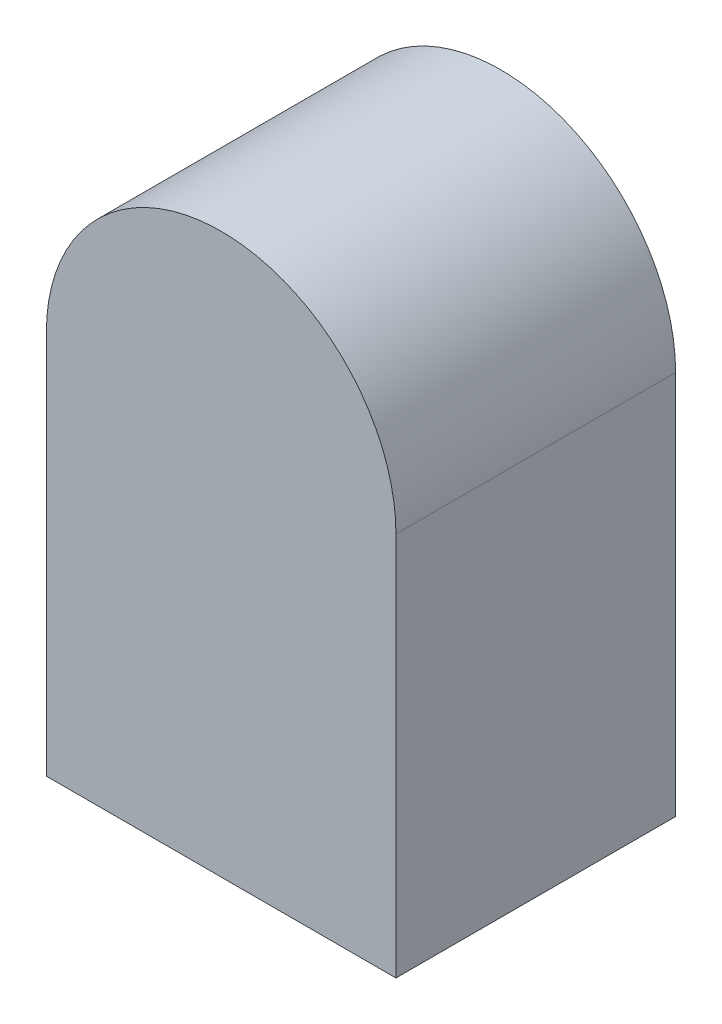
ISO-10303-21;
HEADER;
FILE_DESCRIPTION(('STEP AP214'),'2;1');
FILE_NAME('part.step','',(''),(''),'','','');
FILE_SCHEMA(('AUTOMOTIVE_DESIGN { 1 0 10303 214 1 1 1 1 }'));
ENDSEC;
DATA;
#1=APPLICATION_CONTEXT('core data for automotive mechanical design processes');
#2=APPLICATION_PROTOCOL_DEFINITION('international standard','automotive_design',2000,#1);
#3=PRODUCT_CONTEXT('',#1,'mechanical');
#4=PRODUCT('Part','Part','',(#3));
#5=PRODUCT_RELATED_PRODUCT_CATEGORY('part','',(#4));
#6=PRODUCT_DEFINITION_FORMATION('','',#4);
#7=PRODUCT_DEFINITION_CONTEXT('part definition',#1,'design');
#8=PRODUCT_DEFINITION('design','',#6,#7);
#9=PRODUCT_DEFINITION_SHAPE('','',#8);
#10=(LENGTH_UNIT() NAMED_UNIT(*) SI_UNIT(.MILLI.,.METRE.));
#11=(NAMED_UNIT(*) PLANE_ANGLE_UNIT() SI_UNIT($,.RADIAN.));
#12=(NAMED_UNIT(*) SI_UNIT($,.STERADIAN.) SOLID_ANGLE_UNIT());
#13=UNCERTAINTY_MEASURE_WITH_UNIT(LENGTH_MEASURE(1.E-05),#10,'distance_accuracy_value','');
#14=(GEOMETRIC_REPRESENTATION_CONTEXT(3) GLOBAL_UNCERTAINTY_ASSIGNED_CONTEXT((#13)) GLOBAL_UNIT_ASSIGNED_CONTEXT((#10,
#11,#12)) REPRESENTATION_CONTEXT('',''));
#15=CARTESIAN_POINT('',(0.,0.,0.));
#16=DIRECTION('',(0.,0.,1.));
#17=DIRECTION('',(1.,0.,0.));
#18=AXIS2_PLACEMENT_3D('',#15,#16,#17);
#19=CARTESIAN_POINT('',(0.125000000000004,-0.999999999999999,0.));
#20=DIRECTION('',(1.,0.,0.));
#21=DIRECTION('',(0.,1.,0.));
#22=AXIS2_PLACEMENT_3D('',#19,#20,#21);
#23=PLANE('',#22);
#24=DIRECTION('',(0.,1.,0.));
#25=VECTOR('',#24,1.);
#26=CARTESIAN_POINT('',(0.125000000000004,-0.999999999999999,0.));
#27=LINE('',#26,#25);
#28=CARTESIAN_POINT('',(0.125000000000004,-0.999999999999999,0.));
#29=VERTEX_POINT('',#28);
#30=CARTESIAN_POINT('',(0.125000000000003,-0.724999999999999,0.));
#31=VERTEX_POINT('',#30);
#32=EDGE_CURVE('E11',#29,#31,#27,.T.);
#33=ORIENTED_EDGE('',*,*,#32,.T.);
#34=DIRECTION('',(0.,0.,1.));
#35=VECTOR('',#34,1.);
#36=CARTESIAN_POINT('',(0.125000000000003,-0.724999999999999,0.));
#37=LINE('',#36,#35);
#38=CARTESIAN_POINT('',(0.125000000000003,-0.724999999999999,0.2));
#39=VERTEX_POINT('',#38);
#40=EDGE_CURVE('E24',#31,#39,#37,.T.);
#41=ORIENTED_EDGE('',*,*,#40,.T.);
#42=DIRECTION('',(0.,1.,0.));
#43=VECTOR('',#42,1.);
#44=CARTESIAN_POINT('',(0.125000000000004,-0.999999999999999,0.2));
#45=LINE('',#44,#43);
#46=CARTESIAN_POINT('',(0.125000000000004,-0.999999999999999,0.2));
#47=VERTEX_POINT('',#46);
#48=EDGE_CURVE('E75',#47,#39,#45,.T.);
#49=ORIENTED_EDGE('',*,*,#48,.F.);
#50=DIRECTION('',(0.,0.,1.));
#51=VECTOR('',#50,1.);
#52=CARTESIAN_POINT('',(0.125000000000004,-0.999999999999999,0.));
#53=LINE('',#52,#51);
#54=EDGE_CURVE('E86',#29,#47,#53,.T.);
#55=ORIENTED_EDGE('',*,*,#54,.F.);
#56=EDGE_LOOP('',(#33,#41,#49,#55));
#57=FACE_BOUND('',#56,.T.);
#58=ADVANCED_FACE('F17',(#57),#23,.T.);
#59=CARTESIAN_POINT('',(-0.124999999999991,-1.,0.));
#60=DIRECTION('',(0.,-1.,0.));
#61=DIRECTION('',(1.,0.,0.));
#62=AXIS2_PLACEMENT_3D('',#59,#60,#61);
#63=PLANE('',#62);
#64=DIRECTION('',(1.,0.,0.));
#65=VECTOR('',#64,1.);
#66=CARTESIAN_POINT('',(-0.124999999999991,-1.,0.));
#67=LINE('',#66,#65);
#68=CARTESIAN_POINT('',(-0.124999999999991,-1.,0.));
#69=VERTEX_POINT('',#68);
#70=EDGE_CURVE('E83',#69,#29,#67,.T.);
#71=ORIENTED_EDGE('',*,*,#70,.T.);
#72=ORIENTED_EDGE('',*,*,#54,.T.);
#73=DIRECTION('',(1.,0.,0.));
#74=VECTOR('',#73,1.);
#75=CARTESIAN_POINT('',(-0.124999999999991,-1.,0.2));
#76=LINE('',#75,#74);
#77=CARTESIAN_POINT('',(-0.124999999999991,-1.,0.2));
#78=VERTEX_POINT('',#77);
#79=EDGE_CURVE('E81',#78,#47,#76,.T.);
#80=ORIENTED_EDGE('',*,*,#79,.F.);
#81=DIRECTION('',(0.,0.,1.));
#82=VECTOR('',#81,1.);
#83=CARTESIAN_POINT('',(-0.124999999999991,-1.,0.));
#84=LINE('',#83,#82);
#85=EDGE_CURVE('E61',#69,#78,#84,.T.);
#86=ORIENTED_EDGE('',*,*,#85,.F.);
#87=EDGE_LOOP('',(#71,#72,#80,#86));
#88=FACE_BOUND('',#87,.T.);
#89=ADVANCED_FACE('F91',(#88),#63,.T.);
#90=CARTESIAN_POINT('',(-0.124999999999992,-0.724999999999999,0.));
#91=DIRECTION('',(-1.,0.,0.));
#92=DIRECTION('',(0.,-1.,0.));
#93=AXIS2_PLACEMENT_3D('',#90,#91,#92);
#94=PLANE('',#93);
#95=DIRECTION('',(0.,-1.,0.));
#96=VECTOR('',#95,1.);
#97=CARTESIAN_POINT('',(-0.124999999999992,-0.724999999999999,0.));
#98=LINE('',#97,#96);
#99=CARTESIAN_POINT('',(-0.124999999999992,-0.724999999999999,0.));
#100=VERTEX_POINT('',#99);
#101=EDGE_CURVE('E65',#100,#69,#98,.T.);
#102=ORIENTED_EDGE('',*,*,#101,.T.);
#103=ORIENTED_EDGE('',*,*,#85,.T.);
#104=DIRECTION('',(0.,-1.,0.));
#105=VECTOR('',#104,1.);
#106=CARTESIAN_POINT('',(-0.124999999999992,-0.724999999999999,0.2));
#107=LINE('',#106,#105);
#108=CARTESIAN_POINT('',(-0.124999999999992,-0.724999999999999,0.2));
#109=VERTEX_POINT('',#108);
#110=EDGE_CURVE('E54',#109,#78,#107,.T.);
#111=ORIENTED_EDGE('',*,*,#110,.F.);
#112=DIRECTION('',(0.,0.,1.));
#113=VECTOR('',#112,1.);
#114=CARTESIAN_POINT('',(-0.124999999999992,-0.724999999999999,0.));
#115=LINE('',#114,#113);
#116=EDGE_CURVE('E58',#100,#109,#115,.T.);
#117=ORIENTED_EDGE('',*,*,#116,.F.);
#118=EDGE_LOOP('',(#102,#103,#111,#117));
#119=FACE_BOUND('',#118,.T.);
#120=ADVANCED_FACE('F57',(#119),#94,.T.);
#121=CARTESIAN_POINT('',(0.,-0.724999999999999,0.));
#122=DIRECTION('',(0.,0.,1.));
#123=DIRECTION('',(1.,0.,0.));
#124=AXIS2_PLACEMENT_3D('',#121,#122,#123);
#125=CYLINDRICAL_SURFACE('',#124,0.125);
#126=CARTESIAN_POINT('',(0.,-0.724999999999999,0.));
#127=DIRECTION('',(0.,0.,1.));
#128=DIRECTION('',(1.,0.,0.));
#129=AXIS2_PLACEMENT_3D('',#126,#127,#128);
#130=CIRCLE('',#129,0.125);
#131=EDGE_CURVE('E71',#31,#100,#130,.T.);
#132=ORIENTED_EDGE('',*,*,#131,.T.);
#133=ORIENTED_EDGE('',*,*,#116,.T.);
#134=CARTESIAN_POINT('',(0.,-0.724999999999999,0.2));
#135=DIRECTION('',(0.,0.,1.));
#136=DIRECTION('',(1.,0.,0.));
#137=AXIS2_PLACEMENT_3D('',#134,#135,#136);
#138=CIRCLE('',#137,0.125);
#139=EDGE_CURVE('E70',#39,#109,#138,.T.);
#140=ORIENTED_EDGE('',*,*,#139,.F.);
#141=ORIENTED_EDGE('',*,*,#40,.F.);
#142=EDGE_LOOP('',(#132,#133,#140,#141));
#143=FACE_BOUND('',#142,.T.);
#144=ADVANCED_FACE('F69',(#143),#125,.T.);
#145=CARTESIAN_POINT('',(0.,-0.799999999999999,0.2));
#146=DIRECTION('',(0.,0.,1.));
#147=DIRECTION('',(1.,0.,0.));
#148=AXIS2_PLACEMENT_3D('',#145,#146,#147);
#149=PLANE('',#148);
#150=ORIENTED_EDGE('',*,*,#139,.T.);
#151=ORIENTED_EDGE('',*,*,#110,.T.);
#152=ORIENTED_EDGE('',*,*,#79,.T.);
#153=ORIENTED_EDGE('',*,*,#48,.T.);
#154=EDGE_LOOP('',(#150,#151,#152,#153));
#155=FACE_BOUND('',#154,.T.);
#156=ADVANCED_FACE('F74',(#155),#149,.T.);
#157=CARTESIAN_POINT('',(0.,-0.799999999999999,0.));
#158=DIRECTION('',(0.,0.,1.));
#159=DIRECTION('',(1.,0.,0.));
#160=AXIS2_PLACEMENT_3D('',#157,#158,#159);
#161=PLANE('',#160);
#162=ORIENTED_EDGE('',*,*,#131,.F.);
#163=ORIENTED_EDGE('',*,*,#32,.F.);
#164=ORIENTED_EDGE('',*,*,#70,.F.);
#165=ORIENTED_EDGE('',*,*,#101,.F.);
#166=EDGE_LOOP('',(#162,#163,#164,#165));
#167=FACE_BOUND('',#166,.T.);
#168=ADVANCED_FACE('F89',(#167),#161,.F.);
#169=CLOSED_SHELL('',(#58,#89,#120,#144,#156,#168));
#170=MANIFOLD_SOLID_BREP('B1',#169);
#171=ADVANCED_BREP_SHAPE_REPRESENTATION('',(#18,#170),#14);
#172=SHAPE_DEFINITION_REPRESENTATION(#9,#171);
ENDSEC;
END-ISO-10303-21;
